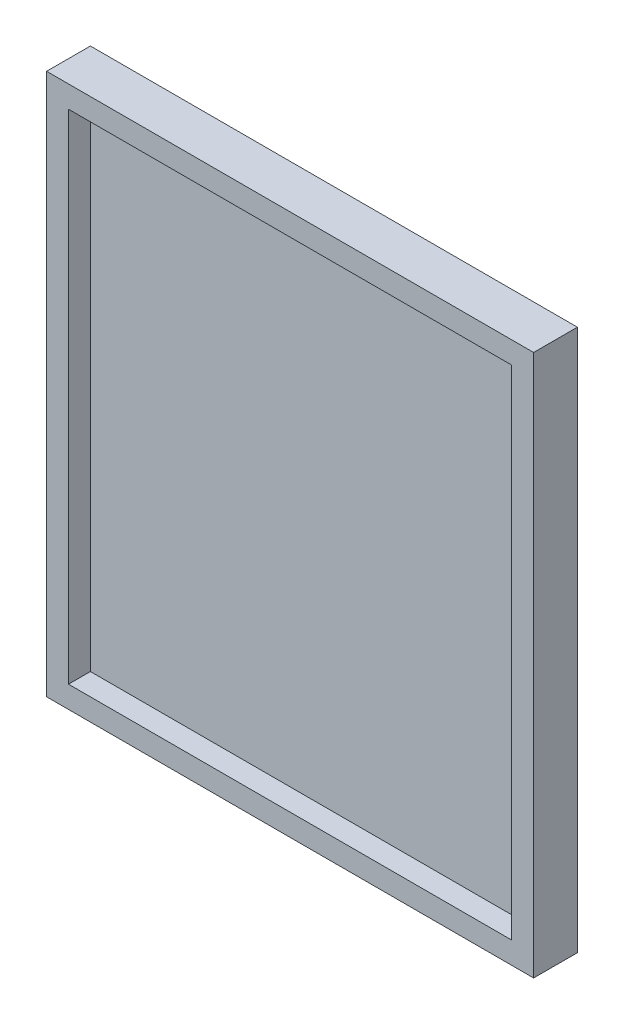
ISO-10303-21;
HEADER;
FILE_DESCRIPTION(('STEP AP214'),'2;1');
FILE_NAME('part.step','',(''),(''),'','','');
FILE_SCHEMA(('AUTOMOTIVE_DESIGN { 1 0 10303 214 1 1 1 1 }'));
ENDSEC;
DATA;
#1=APPLICATION_CONTEXT('core data for automotive mechanical design processes');
#2=APPLICATION_PROTOCOL_DEFINITION('international standard','automotive_design',2000,#1);
#3=PRODUCT_CONTEXT('',#1,'mechanical');
#4=PRODUCT('Part','Part','',(#3));
#5=PRODUCT_RELATED_PRODUCT_CATEGORY('part','',(#4));
#6=PRODUCT_DEFINITION_FORMATION('','',#4);
#7=PRODUCT_DEFINITION_CONTEXT('part definition',#1,'design');
#8=PRODUCT_DEFINITION('design','',#6,#7);
#9=PRODUCT_DEFINITION_SHAPE('','',#8);
#10=(LENGTH_UNIT() NAMED_UNIT(*) SI_UNIT(.MILLI.,.METRE.));
#11=(NAMED_UNIT(*) PLANE_ANGLE_UNIT() SI_UNIT($,.RADIAN.));
#12=(NAMED_UNIT(*) SI_UNIT($,.STERADIAN.) SOLID_ANGLE_UNIT());
#13=UNCERTAINTY_MEASURE_WITH_UNIT(LENGTH_MEASURE(1.E-05),#10,'distance_accuracy_value','');
#14=(GEOMETRIC_REPRESENTATION_CONTEXT(3) GLOBAL_UNCERTAINTY_ASSIGNED_CONTEXT((#13)) GLOBAL_UNIT_ASSIGNED_CONTEXT((#10,
#11,#12)) REPRESENTATION_CONTEXT('',''));
#15=CARTESIAN_POINT('',(0.,0.,0.));
#16=DIRECTION('',(0.,0.,1.));
#17=DIRECTION('',(1.,0.,0.));
#18=AXIS2_PLACEMENT_3D('',#15,#16,#17);
#19=CARTESIAN_POINT('',(0.,0.,12.7));
#20=DIRECTION('',(0.,0.,-1.));
#21=DIRECTION('',(-1.,0.,0.));
#22=AXIS2_PLACEMENT_3D('',#19,#20,#21);
#23=PLANE('',#22);
#24=DIRECTION('',(0.,1.,0.));
#25=VECTOR('',#24,1.);
#26=CARTESIAN_POINT('',(70.64375,-78.58125,12.7));
#27=LINE('',#26,#25);
#28=CARTESIAN_POINT('',(70.64375,-78.58125,12.7));
#29=VERTEX_POINT('',#28);
#30=CARTESIAN_POINT('',(70.64375,78.58125,12.7));
#31=VERTEX_POINT('',#30);
#32=EDGE_CURVE('E161',#29,#31,#27,.T.);
#33=ORIENTED_EDGE('',*,*,#32,.T.);
#34=DIRECTION('',(-1.,0.,0.));
#35=VECTOR('',#34,1.);
#36=CARTESIAN_POINT('',(-70.64375,78.58125,12.7));
#37=LINE('',#36,#35);
#38=CARTESIAN_POINT('',(-70.64375,78.58125,12.7));
#39=VERTEX_POINT('',#38);
#40=EDGE_CURVE('E96',#31,#39,#37,.T.);
#41=ORIENTED_EDGE('',*,*,#40,.T.);
#42=DIRECTION('',(0.,-1.,0.));
#43=VECTOR('',#42,1.);
#44=CARTESIAN_POINT('',(-70.64375,-78.58125,12.7));
#45=LINE('',#44,#43);
#46=CARTESIAN_POINT('',(-70.64375,-78.58125,12.7));
#47=VERTEX_POINT('',#46);
#48=EDGE_CURVE('E166',#39,#47,#45,.T.);
#49=ORIENTED_EDGE('',*,*,#48,.T.);
#50=DIRECTION('',(1.,0.,0.));
#51=VECTOR('',#50,1.);
#52=CARTESIAN_POINT('',(-70.64375,-78.58125,12.7));
#53=LINE('',#52,#51);
#54=EDGE_CURVE('E68',#47,#29,#53,.T.);
#55=ORIENTED_EDGE('',*,*,#54,.T.);
#56=EDGE_LOOP('',(#33,#41,#49,#55));
#57=FACE_BOUND('',#56,.T.);
#58=DIRECTION('',(0.,1.,0.));
#59=VECTOR('',#58,1.);
#60=CARTESIAN_POINT('',(64.29375,0.,12.7));
#61=LINE('',#60,#59);
#62=CARTESIAN_POINT('',(64.29375,-72.23125,12.7));
#63=VERTEX_POINT('',#62);
#64=CARTESIAN_POINT('',(64.29375,72.23125,12.7));
#65=VERTEX_POINT('',#64);
#66=EDGE_CURVE('E145',#63,#65,#61,.T.);
#67=ORIENTED_EDGE('',*,*,#66,.F.);
#68=DIRECTION('',(1.,0.,0.));
#69=VECTOR('',#68,1.);
#70=CARTESIAN_POINT('',(0.,-72.23125,12.7));
#71=LINE('',#70,#69);
#72=CARTESIAN_POINT('',(-64.29375,-72.23125,12.7));
#73=VERTEX_POINT('',#72);
#74=EDGE_CURVE('E158',#73,#63,#71,.T.);
#75=ORIENTED_EDGE('',*,*,#74,.F.);
#76=DIRECTION('',(0.,-1.,0.));
#77=VECTOR('',#76,1.);
#78=CARTESIAN_POINT('',(-64.29375,0.,12.7));
#79=LINE('',#78,#77);
#80=CARTESIAN_POINT('',(-64.29375,72.23125,12.7));
#81=VERTEX_POINT('',#80);
#82=EDGE_CURVE('E155',#81,#73,#79,.T.);
#83=ORIENTED_EDGE('',*,*,#82,.F.);
#84=DIRECTION('',(-1.,0.,0.));
#85=VECTOR('',#84,1.);
#86=CARTESIAN_POINT('',(0.,72.23125,12.7));
#87=LINE('',#86,#85);
#88=EDGE_CURVE('E134',#65,#81,#87,.T.);
#89=ORIENTED_EDGE('',*,*,#88,.F.);
#90=EDGE_LOOP('',(#67,#75,#83,#89));
#91=FACE_BOUND('',#90,.T.);
#92=ADVANCED_FACE('F43',(#57,#91),#23,.F.);
#93=CARTESIAN_POINT('',(70.64375,-78.58125,12.7));
#94=DIRECTION('',(-1.,0.,0.));
#95=DIRECTION('',(0.,0.,1.));
#96=AXIS2_PLACEMENT_3D('',#93,#94,#95);
#97=PLANE('',#96);
#98=DIRECTION('',(0.,1.,0.));
#99=VECTOR('',#98,1.);
#100=CARTESIAN_POINT('',(70.64375,-78.58125,0.));
#101=LINE('',#100,#99);
#102=CARTESIAN_POINT('',(70.64375,-78.58125,0.));
#103=VERTEX_POINT('',#102);
#104=CARTESIAN_POINT('',(70.64375,78.58125,0.));
#105=VERTEX_POINT('',#104);
#106=EDGE_CURVE('E172',#103,#105,#101,.T.);
#107=ORIENTED_EDGE('',*,*,#106,.T.);
#108=DIRECTION('',(0.,0.,-1.));
#109=VECTOR('',#108,1.);
#110=CARTESIAN_POINT('',(70.64375,78.58125,12.7));
#111=LINE('',#110,#109);
#112=EDGE_CURVE('E11',#31,#105,#111,.T.);
#113=ORIENTED_EDGE('',*,*,#112,.F.);
#114=ORIENTED_EDGE('',*,*,#32,.F.);
#115=DIRECTION('',(0.,0.,-1.));
#116=VECTOR('',#115,1.);
#117=CARTESIAN_POINT('',(70.64375,-78.58125,12.7));
#118=LINE('',#117,#116);
#119=EDGE_CURVE('E171',#29,#103,#118,.T.);
#120=ORIENTED_EDGE('',*,*,#119,.T.);
#121=EDGE_LOOP('',(#107,#113,#114,#120));
#122=FACE_BOUND('',#121,.T.);
#123=ADVANCED_FACE('F45',(#122),#97,.F.);
#124=CARTESIAN_POINT('',(-70.64375,78.58125,12.7));
#125=DIRECTION('',(0.,-1.,0.));
#126=DIRECTION('',(0.,0.,-1.));
#127=AXIS2_PLACEMENT_3D('',#124,#125,#126);
#128=PLANE('',#127);
#129=DIRECTION('',(-1.,0.,0.));
#130=VECTOR('',#129,1.);
#131=CARTESIAN_POINT('',(-70.64375,78.58125,0.));
#132=LINE('',#131,#130);
#133=CARTESIAN_POINT('',(-70.64375,78.58125,0.));
#134=VERTEX_POINT('',#133);
#135=EDGE_CURVE('E176',#105,#134,#132,.T.);
#136=ORIENTED_EDGE('',*,*,#135,.T.);
#137=DIRECTION('',(0.,0.,-1.));
#138=VECTOR('',#137,1.);
#139=CARTESIAN_POINT('',(-70.64375,78.58125,12.7));
#140=LINE('',#139,#138);
#141=EDGE_CURVE('E52',#39,#134,#140,.T.);
#142=ORIENTED_EDGE('',*,*,#141,.F.);
#143=ORIENTED_EDGE('',*,*,#40,.F.);
#144=ORIENTED_EDGE('',*,*,#112,.T.);
#145=EDGE_LOOP('',(#136,#142,#143,#144));
#146=FACE_BOUND('',#145,.T.);
#147=ADVANCED_FACE('F210',(#146),#128,.F.);
#148=CARTESIAN_POINT('',(-70.64375,-78.58125,12.7));
#149=DIRECTION('',(1.,0.,0.));
#150=DIRECTION('',(0.,0.,-1.));
#151=AXIS2_PLACEMENT_3D('',#148,#149,#150);
#152=PLANE('',#151);
#153=DIRECTION('',(0.,-1.,0.));
#154=VECTOR('',#153,1.);
#155=CARTESIAN_POINT('',(-70.64375,-78.58125,0.));
#156=LINE('',#155,#154);
#157=CARTESIAN_POINT('',(-70.64375,-78.58125,0.));
#158=VERTEX_POINT('',#157);
#159=EDGE_CURVE('E179',#134,#158,#156,.T.);
#160=ORIENTED_EDGE('',*,*,#159,.T.);
#161=DIRECTION('',(0.,0.,-1.));
#162=VECTOR('',#161,1.);
#163=CARTESIAN_POINT('',(-70.64375,-78.58125,12.7));
#164=LINE('',#163,#162);
#165=EDGE_CURVE('E186',#47,#158,#164,.T.);
#166=ORIENTED_EDGE('',*,*,#165,.F.);
#167=ORIENTED_EDGE('',*,*,#48,.F.);
#168=ORIENTED_EDGE('',*,*,#141,.T.);
#169=EDGE_LOOP('',(#160,#166,#167,#168));
#170=FACE_BOUND('',#169,.T.);
#171=ADVANCED_FACE('F193',(#170),#152,.F.);
#172=CARTESIAN_POINT('',(-70.64375,-78.58125,12.7));
#173=DIRECTION('',(0.,1.,0.));
#174=DIRECTION('',(0.,0.,1.));
#175=AXIS2_PLACEMENT_3D('',#172,#173,#174);
#176=PLANE('',#175);
#177=DIRECTION('',(1.,0.,0.));
#178=VECTOR('',#177,1.);
#179=CARTESIAN_POINT('',(-70.64375,-78.58125,0.));
#180=LINE('',#179,#178);
#181=EDGE_CURVE('E89',#158,#103,#180,.T.);
#182=ORIENTED_EDGE('',*,*,#181,.T.);
#183=ORIENTED_EDGE('',*,*,#119,.F.);
#184=ORIENTED_EDGE('',*,*,#54,.F.);
#185=ORIENTED_EDGE('',*,*,#165,.T.);
#186=EDGE_LOOP('',(#182,#183,#184,#185));
#187=FACE_BOUND('',#186,.T.);
#188=ADVANCED_FACE('F201',(#187),#176,.F.);
#189=CARTESIAN_POINT('',(0.,0.,0.));
#190=DIRECTION('',(0.,0.,-1.));
#191=DIRECTION('',(-1.,0.,0.));
#192=AXIS2_PLACEMENT_3D('',#189,#190,#191);
#193=PLANE('',#192);
#194=ORIENTED_EDGE('',*,*,#106,.F.);
#195=ORIENTED_EDGE('',*,*,#181,.F.);
#196=ORIENTED_EDGE('',*,*,#159,.F.);
#197=ORIENTED_EDGE('',*,*,#135,.F.);
#198=EDGE_LOOP('',(#194,#195,#196,#197));
#199=FACE_BOUND('',#198,.T.);
#200=ADVANCED_FACE('F197',(#199),#193,.T.);
#201=CARTESIAN_POINT('',(64.29375,-78.58125,12.7));
#202=DIRECTION('',(-1.,0.,0.));
#203=DIRECTION('',(0.,0.,1.));
#204=AXIS2_PLACEMENT_3D('',#201,#202,#203);
#205=PLANE('',#204);
#206=DIRECTION('',(0.,1.,0.));
#207=VECTOR('',#206,1.);
#208=CARTESIAN_POINT('',(64.29375,0.,6.35));
#209=LINE('',#208,#207);
#210=CARTESIAN_POINT('',(64.29375,-72.23125,6.35));
#211=VERTEX_POINT('',#210);
#212=CARTESIAN_POINT('',(64.29375,72.23125,6.35));
#213=VERTEX_POINT('',#212);
#214=EDGE_CURVE('E124',#211,#213,#209,.T.);
#215=ORIENTED_EDGE('',*,*,#214,.F.);
#216=DIRECTION('',(0.,0.,-1.));
#217=VECTOR('',#216,1.);
#218=CARTESIAN_POINT('',(64.29375,-72.23125,12.7));
#219=LINE('',#218,#217);
#220=EDGE_CURVE('E149',#63,#211,#219,.T.);
#221=ORIENTED_EDGE('',*,*,#220,.F.);
#222=ORIENTED_EDGE('',*,*,#66,.T.);
#223=DIRECTION('',(0.,0.,-1.));
#224=VECTOR('',#223,1.);
#225=CARTESIAN_POINT('',(64.29375,72.23125,12.7));
#226=LINE('',#225,#224);
#227=EDGE_CURVE('E138',#65,#213,#226,.T.);
#228=ORIENTED_EDGE('',*,*,#227,.T.);
#229=EDGE_LOOP('',(#215,#221,#222,#228));
#230=FACE_BOUND('',#229,.T.);
#231=ADVANCED_FACE('F208',(#230),#205,.T.);
#232=CARTESIAN_POINT('',(-70.64375,72.23125,12.7));
#233=DIRECTION('',(0.,-1.,0.));
#234=DIRECTION('',(0.,0.,-1.));
#235=AXIS2_PLACEMENT_3D('',#232,#233,#234);
#236=PLANE('',#235);
#237=DIRECTION('',(-1.,0.,0.));
#238=VECTOR('',#237,1.);
#239=CARTESIAN_POINT('',(0.,72.23125,6.35));
#240=LINE('',#239,#238);
#241=CARTESIAN_POINT('',(-64.29375,72.23125,6.35));
#242=VERTEX_POINT('',#241);
#243=EDGE_CURVE('E118',#213,#242,#240,.T.);
#244=ORIENTED_EDGE('',*,*,#243,.F.);
#245=ORIENTED_EDGE('',*,*,#227,.F.);
#246=ORIENTED_EDGE('',*,*,#88,.T.);
#247=DIRECTION('',(0.,0.,-1.));
#248=VECTOR('',#247,1.);
#249=CARTESIAN_POINT('',(-64.29375,72.23125,12.7));
#250=LINE('',#249,#248);
#251=EDGE_CURVE('E131',#81,#242,#250,.T.);
#252=ORIENTED_EDGE('',*,*,#251,.T.);
#253=EDGE_LOOP('',(#244,#245,#246,#252));
#254=FACE_BOUND('',#253,.T.);
#255=ADVANCED_FACE('F132',(#254),#236,.T.);
#256=CARTESIAN_POINT('',(-64.29375,-78.58125,12.7));
#257=DIRECTION('',(1.,0.,0.));
#258=DIRECTION('',(0.,0.,-1.));
#259=AXIS2_PLACEMENT_3D('',#256,#257,#258);
#260=PLANE('',#259);
#261=DIRECTION('',(0.,-1.,0.));
#262=VECTOR('',#261,1.);
#263=CARTESIAN_POINT('',(-64.29375,0.,6.35));
#264=LINE('',#263,#262);
#265=CARTESIAN_POINT('',(-64.29375,-72.23125,6.35));
#266=VERTEX_POINT('',#265);
#267=EDGE_CURVE('E122',#242,#266,#264,.T.);
#268=ORIENTED_EDGE('',*,*,#267,.F.);
#269=ORIENTED_EDGE('',*,*,#251,.F.);
#270=ORIENTED_EDGE('',*,*,#82,.T.);
#271=DIRECTION('',(0.,0.,-1.));
#272=VECTOR('',#271,1.);
#273=CARTESIAN_POINT('',(-64.29375,-72.23125,12.7));
#274=LINE('',#273,#272);
#275=EDGE_CURVE('E59',#73,#266,#274,.T.);
#276=ORIENTED_EDGE('',*,*,#275,.T.);
#277=EDGE_LOOP('',(#268,#269,#270,#276));
#278=FACE_BOUND('',#277,.T.);
#279=ADVANCED_FACE('F140',(#278),#260,.T.);
#280=CARTESIAN_POINT('',(-70.64375,-72.23125,12.7));
#281=DIRECTION('',(0.,1.,0.));
#282=DIRECTION('',(0.,0.,1.));
#283=AXIS2_PLACEMENT_3D('',#280,#281,#282);
#284=PLANE('',#283);
#285=DIRECTION('',(1.,0.,0.));
#286=VECTOR('',#285,1.);
#287=CARTESIAN_POINT('',(0.,-72.23125,6.35));
#288=LINE('',#287,#286);
#289=EDGE_CURVE('E142',#266,#211,#288,.T.);
#290=ORIENTED_EDGE('',*,*,#289,.F.);
#291=ORIENTED_EDGE('',*,*,#275,.F.);
#292=ORIENTED_EDGE('',*,*,#74,.T.);
#293=ORIENTED_EDGE('',*,*,#220,.T.);
#294=EDGE_LOOP('',(#290,#291,#292,#293));
#295=FACE_BOUND('',#294,.T.);
#296=ADVANCED_FACE('F221',(#295),#284,.T.);
#297=CARTESIAN_POINT('',(0.,0.,6.35));
#298=DIRECTION('',(0.,0.,-1.));
#299=DIRECTION('',(-1.,0.,0.));
#300=AXIS2_PLACEMENT_3D('',#297,#298,#299);
#301=PLANE('',#300);
#302=ORIENTED_EDGE('',*,*,#214,.T.);
#303=ORIENTED_EDGE('',*,*,#243,.T.);
#304=ORIENTED_EDGE('',*,*,#267,.T.);
#305=ORIENTED_EDGE('',*,*,#289,.T.);
#306=EDGE_LOOP('',(#302,#303,#304,#305));
#307=FACE_BOUND('',#306,.T.);
#308=ADVANCED_FACE('F120',(#307),#301,.F.);
#309=CLOSED_SHELL('',(#92,#123,#147,#171,#188,#200,#231,#255,#279,#296,#308));
#310=MANIFOLD_SOLID_BREP('B2',#309);
#311=ADVANCED_BREP_SHAPE_REPRESENTATION('',(#18,#310),#14);
#312=SHAPE_DEFINITION_REPRESENTATION(#9,#311);
ENDSEC;
END-ISO-10303-21;
